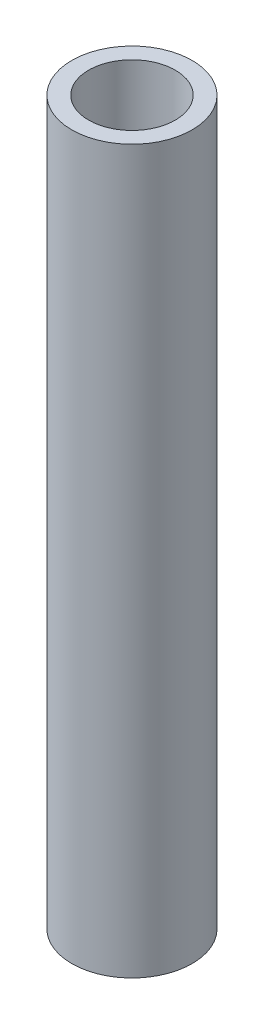
ISO-10303-21;
HEADER;
FILE_DESCRIPTION(('STEP AP214'),'2;1');
FILE_NAME('part.step','',(''),(''),'','','');
FILE_SCHEMA(('AUTOMOTIVE_DESIGN { 1 0 10303 214 1 1 1 1 }'));
ENDSEC;
DATA;
#1=APPLICATION_CONTEXT('core data for automotive mechanical design processes');
#2=APPLICATION_PROTOCOL_DEFINITION('international standard','automotive_design',2000,#1);
#3=PRODUCT_CONTEXT('',#1,'mechanical');
#4=PRODUCT('Part','Part','',(#3));
#5=PRODUCT_RELATED_PRODUCT_CATEGORY('part','',(#4));
#6=PRODUCT_DEFINITION_FORMATION('','',#4);
#7=PRODUCT_DEFINITION_CONTEXT('part definition',#1,'design');
#8=PRODUCT_DEFINITION('design','',#6,#7);
#9=PRODUCT_DEFINITION_SHAPE('','',#8);
#10=(LENGTH_UNIT() NAMED_UNIT(*) SI_UNIT(.MILLI.,.METRE.));
#11=(NAMED_UNIT(*) PLANE_ANGLE_UNIT() SI_UNIT($,.RADIAN.));
#12=(NAMED_UNIT(*) SI_UNIT($,.STERADIAN.) SOLID_ANGLE_UNIT());
#13=UNCERTAINTY_MEASURE_WITH_UNIT(LENGTH_MEASURE(1.E-05),#10,'distance_accuracy_value','');
#14=(GEOMETRIC_REPRESENTATION_CONTEXT(3) GLOBAL_UNCERTAINTY_ASSIGNED_CONTEXT((#13)) GLOBAL_UNIT_ASSIGNED_CONTEXT((#10,
#11,#12)) REPRESENTATION_CONTEXT('',''));
#15=CARTESIAN_POINT('',(0.,0.,0.));
#16=DIRECTION('',(0.,0.,1.));
#17=DIRECTION('',(1.,0.,0.));
#18=AXIS2_PLACEMENT_3D('',#15,#16,#17);
#19=CARTESIAN_POINT('',(0.,38.1,0.));
#20=DIRECTION('',(0.,1.,0.));
#21=DIRECTION('',(0.,0.,1.));
#22=AXIS2_PLACEMENT_3D('',#19,#20,#21);
#23=PLANE('',#22);
#24=CARTESIAN_POINT('',(0.,38.1,0.));
#25=DIRECTION('',(0.,1.,0.));
#26=DIRECTION('',(0.,0.,1.));
#27=AXIS2_PLACEMENT_3D('',#24,#25,#26);
#28=CIRCLE('',#27,3.175);
#29=CARTESIAN_POINT('',(0.,38.1,3.175));
#30=VERTEX_POINT('',#29);
#31=EDGE_CURVE('E10',#30,#30,#28,.T.);
#32=ORIENTED_EDGE('',*,*,#31,.T.);
#33=EDGE_LOOP('',(#32));
#34=FACE_BOUND('',#33,.T.);
#35=CARTESIAN_POINT('',(0.,38.1,0.));
#36=DIRECTION('',(0.,1.,0.));
#37=DIRECTION('',(0.,0.,1.));
#38=AXIS2_PLACEMENT_3D('',#35,#36,#37);
#39=CIRCLE('',#38,2.286);
#40=CARTESIAN_POINT('',(0.,38.1,2.286));
#41=VERTEX_POINT('',#40);
#42=EDGE_CURVE('E42',#41,#41,#39,.T.);
#43=ORIENTED_EDGE('',*,*,#42,.F.);
#44=EDGE_LOOP('',(#43));
#45=FACE_BOUND('',#44,.T.);
#46=ADVANCED_FACE('F31',(#34,#45),#23,.T.);
#47=CARTESIAN_POINT('',(0.,0.,0.));
#48=DIRECTION('',(0.,1.,0.));
#49=DIRECTION('',(0.,0.,1.));
#50=AXIS2_PLACEMENT_3D('',#47,#48,#49);
#51=PLANE('',#50);
#52=CARTESIAN_POINT('',(0.,0.,0.));
#53=DIRECTION('',(0.,1.,0.));
#54=DIRECTION('',(0.,0.,1.));
#55=AXIS2_PLACEMENT_3D('',#52,#53,#54);
#56=CIRCLE('',#55,3.175);
#57=CARTESIAN_POINT('',(0.,0.,3.175));
#58=VERTEX_POINT('',#57);
#59=EDGE_CURVE('E35',#58,#58,#56,.T.);
#60=ORIENTED_EDGE('',*,*,#59,.F.);
#61=EDGE_LOOP('',(#60));
#62=FACE_BOUND('',#61,.T.);
#63=CARTESIAN_POINT('',(0.,0.,0.));
#64=DIRECTION('',(0.,1.,0.));
#65=DIRECTION('',(0.,0.,1.));
#66=AXIS2_PLACEMENT_3D('',#63,#64,#65);
#67=CIRCLE('',#66,2.286);
#68=CARTESIAN_POINT('',(0.,0.,2.286));
#69=VERTEX_POINT('',#68);
#70=EDGE_CURVE('E44',#69,#69,#67,.T.);
#71=ORIENTED_EDGE('',*,*,#70,.T.);
#72=EDGE_LOOP('',(#71));
#73=FACE_BOUND('',#72,.T.);
#74=ADVANCED_FACE('F54',(#62,#73),#51,.F.);
#75=CARTESIAN_POINT('',(0.,38.1,0.));
#76=DIRECTION('',(0.,-1.,0.));
#77=DIRECTION('',(0.,0.,-1.));
#78=AXIS2_PLACEMENT_3D('',#75,#76,#77);
#79=CYLINDRICAL_SURFACE('',#78,3.175);
#80=ORIENTED_EDGE('',*,*,#31,.F.);
#81=EDGE_LOOP('',(#80));
#82=FACE_BOUND('',#81,.T.);
#83=ORIENTED_EDGE('',*,*,#59,.T.);
#84=EDGE_LOOP('',(#83));
#85=FACE_BOUND('',#84,.T.);
#86=ADVANCED_FACE('F33',(#82,#85),#79,.T.);
#87=CARTESIAN_POINT('',(0.,38.1,0.));
#88=DIRECTION('',(0.,-1.,0.));
#89=DIRECTION('',(0.,0.,-1.));
#90=AXIS2_PLACEMENT_3D('',#87,#88,#89);
#91=CYLINDRICAL_SURFACE('',#90,2.286);
#92=ORIENTED_EDGE('',*,*,#42,.T.);
#93=EDGE_LOOP('',(#92));
#94=FACE_BOUND('',#93,.T.);
#95=ORIENTED_EDGE('',*,*,#70,.F.);
#96=EDGE_LOOP('',(#95));
#97=FACE_BOUND('',#96,.T.);
#98=ADVANCED_FACE('F50',(#94,#97),#91,.F.);
#99=CLOSED_SHELL('',(#46,#74,#86,#98));
#100=MANIFOLD_SOLID_BREP('B2',#99);
#101=ADVANCED_BREP_SHAPE_REPRESENTATION('',(#18,#100),#14);
#102=SHAPE_DEFINITION_REPRESENTATION(#9,#101);
ENDSEC;
END-ISO-10303-21;
